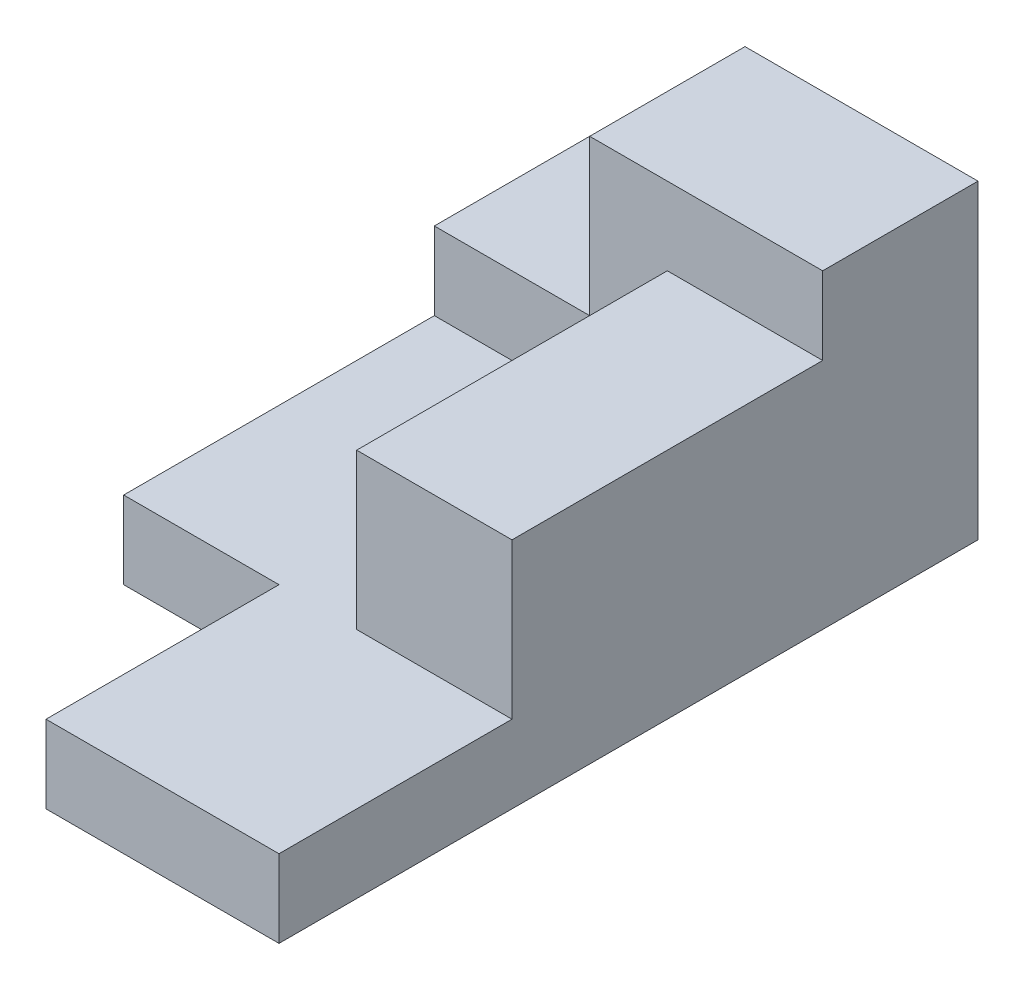
ISO-10303-21;
HEADER;
FILE_DESCRIPTION(('STEP AP214'),'2;1');
FILE_NAME('part.step','',(''),(''),'','','');
FILE_SCHEMA(('AUTOMOTIVE_DESIGN { 1 0 10303 214 1 1 1 1 }'));
ENDSEC;
DATA;
#1=APPLICATION_CONTEXT('core data for automotive mechanical design processes');
#2=APPLICATION_PROTOCOL_DEFINITION('international standard','automotive_design',2000,#1);
#3=PRODUCT_CONTEXT('',#1,'mechanical');
#4=PRODUCT('Part','Part','',(#3));
#5=PRODUCT_RELATED_PRODUCT_CATEGORY('part','',(#4));
#6=PRODUCT_DEFINITION_FORMATION('','',#4);
#7=PRODUCT_DEFINITION_CONTEXT('part definition',#1,'design');
#8=PRODUCT_DEFINITION('design','',#6,#7);
#9=PRODUCT_DEFINITION_SHAPE('','',#8);
#10=(LENGTH_UNIT() NAMED_UNIT(*) SI_UNIT(.MILLI.,.METRE.));
#11=(NAMED_UNIT(*) PLANE_ANGLE_UNIT() SI_UNIT($,.RADIAN.));
#12=(NAMED_UNIT(*) SI_UNIT($,.STERADIAN.) SOLID_ANGLE_UNIT());
#13=UNCERTAINTY_MEASURE_WITH_UNIT(LENGTH_MEASURE(1.E-05),#10,'distance_accuracy_value','');
#14=(GEOMETRIC_REPRESENTATION_CONTEXT(3) GLOBAL_UNCERTAINTY_ASSIGNED_CONTEXT((#13)) GLOBAL_UNIT_ASSIGNED_CONTEXT((#10,
#11,#12)) REPRESENTATION_CONTEXT('',''));
#15=CARTESIAN_POINT('',(0.,0.,0.));
#16=DIRECTION('',(0.,0.,1.));
#17=DIRECTION('',(1.,0.,0.));
#18=AXIS2_PLACEMENT_3D('',#15,#16,#17);
#19=CARTESIAN_POINT('',(0.,10.,0.));
#20=DIRECTION('',(0.,1.,0.));
#21=DIRECTION('',(0.,0.,1.));
#22=AXIS2_PLACEMENT_3D('',#19,#20,#21);
#23=PLANE('',#22);
#24=DIRECTION('',(1.,0.,0.));
#25=VECTOR('',#24,1.);
#26=CARTESIAN_POINT('',(19.7674418604651,10.,36.1627906976744));
#27=LINE('',#26,#25);
#28=CARTESIAN_POINT('',(-0.232558139534853,10.,36.1627906976744));
#29=VERTEX_POINT('',#28);
#30=CARTESIAN_POINT('',(19.7674418604652,10.,36.1627906976744));
#31=VERTEX_POINT('',#30);
#32=EDGE_CURVE('E55',#29,#31,#27,.T.);
#33=ORIENTED_EDGE('',*,*,#32,.F.);
#34=DIRECTION('',(0.,0.,1.));
#35=VECTOR('',#34,1.);
#36=CARTESIAN_POINT('',(-0.232558139534858,10.,-3.83720930232558));
#37=LINE('',#36,#35);
#38=CARTESIAN_POINT('',(-0.232558139534857,10.,-3.83720930232558));
#39=VERTEX_POINT('',#38);
#40=EDGE_CURVE('E166',#39,#29,#37,.T.);
#41=ORIENTED_EDGE('',*,*,#40,.F.);
#42=DIRECTION('',(1.,0.,0.));
#43=VECTOR('',#42,1.);
#44=CARTESIAN_POINT('',(-30.2325581395349,10.,-3.83720930232558));
#45=LINE('',#44,#43);
#46=CARTESIAN_POINT('',(-30.2325581395349,10.,-3.83720930232559));
#47=VERTEX_POINT('',#46);
#48=EDGE_CURVE('E139',#47,#39,#45,.T.);
#49=ORIENTED_EDGE('',*,*,#48,.F.);
#50=DIRECTION('',(0.,0.,1.));
#51=VECTOR('',#50,1.);
#52=CARTESIAN_POINT('',(-30.2325581395349,10.,-23.8372093023256));
#53=LINE('',#52,#51);
#54=CARTESIAN_POINT('',(-30.2325581395349,10.,36.1627906976744));
#55=VERTEX_POINT('',#54);
#56=EDGE_CURVE('E247',#47,#55,#53,.T.);
#57=ORIENTED_EDGE('',*,*,#56,.T.);
#58=DIRECTION('',(-1.,0.,0.));
#59=VECTOR('',#58,1.);
#60=CARTESIAN_POINT('',(0.,10.,36.1627906976744));
#61=LINE('',#60,#59);
#62=CARTESIAN_POINT('',(-10.2325581395349,10.,36.1627906976744));
#63=VERTEX_POINT('',#62);
#64=EDGE_CURVE('E242',#63,#55,#61,.T.);
#65=ORIENTED_EDGE('',*,*,#64,.F.);
#66=DIRECTION('',(0.,0.,-1.));
#67=VECTOR('',#66,1.);
#68=CARTESIAN_POINT('',(-10.2325581395349,10.,0.));
#69=LINE('',#68,#67);
#70=CARTESIAN_POINT('',(-10.2325581395349,10.,66.1627906976744));
#71=VERTEX_POINT('',#70);
#72=EDGE_CURVE('E233',#71,#63,#69,.T.);
#73=ORIENTED_EDGE('',*,*,#72,.F.);
#74=DIRECTION('',(1.,0.,0.));
#75=VECTOR('',#74,1.);
#76=CARTESIAN_POINT('',(-30.2325581395348,10.,66.1627906976744));
#77=LINE('',#76,#75);
#78=CARTESIAN_POINT('',(19.7674418604652,10.,66.1627906976744));
#79=VERTEX_POINT('',#78);
#80=EDGE_CURVE('E250',#71,#79,#77,.T.);
#81=ORIENTED_EDGE('',*,*,#80,.T.);
#82=DIRECTION('',(0.,0.,-1.));
#83=VECTOR('',#82,1.);
#84=CARTESIAN_POINT('',(19.7674418604651,10.,-23.8372093023256));
#85=LINE('',#84,#83);
#86=EDGE_CURVE('E60',#79,#31,#85,.T.);
#87=ORIENTED_EDGE('',*,*,#86,.T.);
#88=EDGE_LOOP('',(#33,#41,#49,#57,#65,#73,#81,#87));
#89=FACE_BOUND('',#88,.T.);
#90=ADVANCED_FACE('F39',(#89),#23,.T.);
#91=CARTESIAN_POINT('',(-30.2325581395349,20.,-3.83720930232558));
#92=DIRECTION('',(0.,0.,-1.));
#93=DIRECTION('',(-1.,0.,0.));
#94=AXIS2_PLACEMENT_3D('',#91,#92,#93);
#95=PLANE('',#94);
#96=DIRECTION('',(0.,-1.,0.));
#97=VECTOR('',#96,1.);
#98=CARTESIAN_POINT('',(-0.232558139534858,30.,-3.83720930232558));
#99=LINE('',#98,#97);
#100=CARTESIAN_POINT('',(-0.232558139534858,30.,-3.83720930232558));
#101=VERTEX_POINT('',#100);
#102=EDGE_CURVE('E133',#101,#39,#99,.T.);
#103=ORIENTED_EDGE('',*,*,#102,.F.);
#104=DIRECTION('',(-1.,0.,0.));
#105=VECTOR('',#104,1.);
#106=CARTESIAN_POINT('',(19.7674418604651,30.,-3.83720930232558));
#107=LINE('',#106,#105);
#108=CARTESIAN_POINT('',(19.7674418604651,30.,-3.83720930232558));
#109=VERTEX_POINT('',#108);
#110=EDGE_CURVE('E136',#109,#101,#107,.T.);
#111=ORIENTED_EDGE('',*,*,#110,.F.);
#112=DIRECTION('',(0.,-1.,0.));
#113=VECTOR('',#112,1.);
#114=CARTESIAN_POINT('',(19.7674418604651,20.,-3.83720930232558));
#115=LINE('',#114,#113);
#116=CARTESIAN_POINT('',(19.7674418604651,40.,-3.83720930232558));
#117=VERTEX_POINT('',#116);
#118=EDGE_CURVE('E212',#117,#109,#115,.T.);
#119=ORIENTED_EDGE('',*,*,#118,.F.);
#120=DIRECTION('',(1.,0.,0.));
#121=VECTOR('',#120,1.);
#122=CARTESIAN_POINT('',(-10.2325581395349,40.,-3.83720930232558));
#123=LINE('',#122,#121);
#124=CARTESIAN_POINT('',(-10.2325581395349,40.,-3.83720930232558));
#125=VERTEX_POINT('',#124);
#126=EDGE_CURVE('E180',#125,#117,#123,.T.);
#127=ORIENTED_EDGE('',*,*,#126,.F.);
#128=DIRECTION('',(0.,-1.,0.));
#129=VECTOR('',#128,1.);
#130=CARTESIAN_POINT('',(-10.2325581395349,40.,-3.83720930232558));
#131=LINE('',#130,#129);
#132=CARTESIAN_POINT('',(-10.2325581395349,20.,-3.83720930232558));
#133=VERTEX_POINT('',#132);
#134=EDGE_CURVE('E198',#125,#133,#131,.T.);
#135=ORIENTED_EDGE('',*,*,#134,.T.);
#136=DIRECTION('',(1.,0.,0.));
#137=VECTOR('',#136,1.);
#138=CARTESIAN_POINT('',(-30.2325581395349,20.,-3.83720930232558));
#139=LINE('',#138,#137);
#140=CARTESIAN_POINT('',(-30.2325581395349,20.,-3.83720930232558));
#141=VERTEX_POINT('',#140);
#142=EDGE_CURVE('E206',#141,#133,#139,.T.);
#143=ORIENTED_EDGE('',*,*,#142,.F.);
#144=DIRECTION('',(0.,-1.,0.));
#145=VECTOR('',#144,1.);
#146=CARTESIAN_POINT('',(-30.2325581395349,20.,-3.83720930232558));
#147=LINE('',#146,#145);
#148=EDGE_CURVE('E217',#141,#47,#147,.T.);
#149=ORIENTED_EDGE('',*,*,#148,.T.);
#150=ORIENTED_EDGE('',*,*,#48,.T.);
#151=EDGE_LOOP('',(#103,#111,#119,#127,#135,#143,#149,#150));
#152=FACE_BOUND('',#151,.T.);
#153=ADVANCED_FACE('F135',(#152),#95,.F.);
#154=CARTESIAN_POINT('',(-30.2325581395349,10.,-23.8372093023256));
#155=DIRECTION('',(1.,0.,0.));
#156=DIRECTION('',(0.,0.,-1.));
#157=AXIS2_PLACEMENT_3D('',#154,#155,#156);
#158=PLANE('',#157);
#159=DIRECTION('',(0.,0.,1.));
#160=VECTOR('',#159,1.);
#161=CARTESIAN_POINT('',(-30.2325581395349,0.,-23.8372093023256));
#162=LINE('',#161,#160);
#163=CARTESIAN_POINT('',(-30.2325581395349,0.,-23.8372093023256));
#164=VERTEX_POINT('',#163);
#165=CARTESIAN_POINT('',(-30.2325581395349,0.,36.1627906976744));
#166=VERTEX_POINT('',#165);
#167=EDGE_CURVE('E246',#164,#166,#162,.T.);
#168=ORIENTED_EDGE('',*,*,#167,.T.);
#169=DIRECTION('',(0.,1.,0.));
#170=VECTOR('',#169,1.);
#171=CARTESIAN_POINT('',(-30.2325581395349,0.,36.1627906976744));
#172=LINE('',#171,#170);
#173=EDGE_CURVE('E229',#166,#55,#172,.T.);
#174=ORIENTED_EDGE('',*,*,#173,.T.);
#175=ORIENTED_EDGE('',*,*,#56,.F.);
#176=ORIENTED_EDGE('',*,*,#148,.F.);
#177=DIRECTION('',(0.,0.,1.));
#178=VECTOR('',#177,1.);
#179=CARTESIAN_POINT('',(-30.2325581395349,20.,-23.8372093023256));
#180=LINE('',#179,#178);
#181=CARTESIAN_POINT('',(-30.2325581395349,20.,-23.8372093023256));
#182=VERTEX_POINT('',#181);
#183=EDGE_CURVE('E202',#182,#141,#180,.T.);
#184=ORIENTED_EDGE('',*,*,#183,.F.);
#185=DIRECTION('',(0.,-1.,0.));
#186=VECTOR('',#185,1.);
#187=CARTESIAN_POINT('',(-30.2325581395349,10.,-23.8372093023256));
#188=LINE('',#187,#186);
#189=EDGE_CURVE('E256',#182,#164,#188,.T.);
#190=ORIENTED_EDGE('',*,*,#189,.T.);
#191=EDGE_LOOP('',(#168,#174,#175,#176,#184,#190));
#192=FACE_BOUND('',#191,.T.);
#193=ADVANCED_FACE('F41',(#192),#158,.F.);
#194=CARTESIAN_POINT('',(-30.2325581395348,10.,66.1627906976744));
#195=DIRECTION('',(0.,0.,-1.));
#196=DIRECTION('',(-1.,0.,0.));
#197=AXIS2_PLACEMENT_3D('',#194,#195,#196);
#198=PLANE('',#197);
#199=ORIENTED_EDGE('',*,*,#80,.F.);
#200=DIRECTION('',(0.,1.,0.));
#201=VECTOR('',#200,1.);
#202=CARTESIAN_POINT('',(-10.2325581395349,0.,66.1627906976744));
#203=LINE('',#202,#201);
#204=CARTESIAN_POINT('',(-10.2325581395349,0.,66.1627906976744));
#205=VERTEX_POINT('',#204);
#206=EDGE_CURVE('E228',#205,#71,#203,.T.);
#207=ORIENTED_EDGE('',*,*,#206,.F.);
#208=DIRECTION('',(1.,0.,0.));
#209=VECTOR('',#208,1.);
#210=CARTESIAN_POINT('',(-30.2325581395348,0.,66.1627906976744));
#211=LINE('',#210,#209);
#212=CARTESIAN_POINT('',(19.7674418604652,0.,66.1627906976744));
#213=VERTEX_POINT('',#212);
#214=EDGE_CURVE('E260',#205,#213,#211,.T.);
#215=ORIENTED_EDGE('',*,*,#214,.T.);
#216=DIRECTION('',(0.,-1.,0.));
#217=VECTOR('',#216,1.);
#218=CARTESIAN_POINT('',(19.7674418604652,10.,66.1627906976744));
#219=LINE('',#218,#217);
#220=EDGE_CURVE('E11',#79,#213,#219,.T.);
#221=ORIENTED_EDGE('',*,*,#220,.F.);
#222=EDGE_LOOP('',(#199,#207,#215,#221));
#223=FACE_BOUND('',#222,.T.);
#224=ADVANCED_FACE('F310',(#223),#198,.F.);
#225=CARTESIAN_POINT('',(19.7674418604651,10.,-23.8372093023256));
#226=DIRECTION('',(-1.,0.,0.));
#227=DIRECTION('',(0.,0.,1.));
#228=AXIS2_PLACEMENT_3D('',#225,#226,#227);
#229=PLANE('',#228);
#230=DIRECTION('',(0.,0.,-1.));
#231=VECTOR('',#230,1.);
#232=CARTESIAN_POINT('',(19.7674418604651,0.,-23.8372093023256));
#233=LINE('',#232,#231);
#234=CARTESIAN_POINT('',(19.7674418604651,0.,-23.8372093023256));
#235=VERTEX_POINT('',#234);
#236=EDGE_CURVE('E263',#213,#235,#233,.T.);
#237=ORIENTED_EDGE('',*,*,#236,.T.);
#238=DIRECTION('',(0.,-1.,0.));
#239=VECTOR('',#238,1.);
#240=CARTESIAN_POINT('',(19.7674418604651,10.,-23.8372093023256));
#241=LINE('',#240,#239);
#242=CARTESIAN_POINT('',(19.7674418604651,40.,-23.8372093023256));
#243=VERTEX_POINT('',#242);
#244=EDGE_CURVE('E48',#243,#235,#241,.T.);
#245=ORIENTED_EDGE('',*,*,#244,.F.);
#246=DIRECTION('',(0.,0.,-1.));
#247=VECTOR('',#246,1.);
#248=CARTESIAN_POINT('',(19.7674418604651,40.,-3.83720930232558));
#249=LINE('',#248,#247);
#250=EDGE_CURVE('E184',#117,#243,#249,.T.);
#251=ORIENTED_EDGE('',*,*,#250,.F.);
#252=ORIENTED_EDGE('',*,*,#118,.T.);
#253=DIRECTION('',(0.,0.,-1.));
#254=VECTOR('',#253,1.);
#255=CARTESIAN_POINT('',(19.7674418604651,30.,-3.83720930232558));
#256=LINE('',#255,#254);
#257=CARTESIAN_POINT('',(19.7674418604651,30.,36.1627906976744));
#258=VERTEX_POINT('',#257);
#259=EDGE_CURVE('E152',#258,#109,#256,.T.);
#260=ORIENTED_EDGE('',*,*,#259,.F.);
#261=DIRECTION('',(0.,-1.,0.));
#262=VECTOR('',#261,1.);
#263=CARTESIAN_POINT('',(19.7674418604651,30.,36.1627906976744));
#264=LINE('',#263,#262);
#265=EDGE_CURVE('E162',#258,#31,#264,.T.);
#266=ORIENTED_EDGE('',*,*,#265,.T.);
#267=ORIENTED_EDGE('',*,*,#86,.F.);
#268=ORIENTED_EDGE('',*,*,#220,.T.);
#269=EDGE_LOOP('',(#237,#245,#251,#252,#260,#266,#267,#268));
#270=FACE_BOUND('',#269,.T.);
#271=ADVANCED_FACE('F297',(#270),#229,.F.);
#272=CARTESIAN_POINT('',(-30.2325581395349,10.,-23.8372093023256));
#273=DIRECTION('',(0.,0.,1.));
#274=DIRECTION('',(1.,0.,0.));
#275=AXIS2_PLACEMENT_3D('',#272,#273,#274);
#276=PLANE('',#275);
#277=DIRECTION('',(-1.,0.,0.));
#278=VECTOR('',#277,1.);
#279=CARTESIAN_POINT('',(-30.2325581395349,0.,-23.8372093023256));
#280=LINE('',#279,#278);
#281=EDGE_CURVE('E251',#235,#164,#280,.T.);
#282=ORIENTED_EDGE('',*,*,#281,.T.);
#283=ORIENTED_EDGE('',*,*,#189,.F.);
#284=DIRECTION('',(-1.,0.,0.));
#285=VECTOR('',#284,1.);
#286=CARTESIAN_POINT('',(-30.2325581395349,20.,-23.8372093023256));
#287=LINE('',#286,#285);
#288=CARTESIAN_POINT('',(-10.2325581395349,20.,-23.8372093023256));
#289=VERTEX_POINT('',#288);
#290=EDGE_CURVE('E209',#289,#182,#287,.T.);
#291=ORIENTED_EDGE('',*,*,#290,.F.);
#292=DIRECTION('',(0.,-1.,0.));
#293=VECTOR('',#292,1.);
#294=CARTESIAN_POINT('',(-10.2325581395349,40.,-23.8372093023256));
#295=LINE('',#294,#293);
#296=CARTESIAN_POINT('',(-10.2325581395349,40.,-23.8372093023256));
#297=VERTEX_POINT('',#296);
#298=EDGE_CURVE('E191',#297,#289,#295,.T.);
#299=ORIENTED_EDGE('',*,*,#298,.F.);
#300=DIRECTION('',(-1.,0.,0.));
#301=VECTOR('',#300,1.);
#302=CARTESIAN_POINT('',(-10.2325581395349,40.,-23.8372093023256));
#303=LINE('',#302,#301);
#304=EDGE_CURVE('E188',#243,#297,#303,.T.);
#305=ORIENTED_EDGE('',*,*,#304,.F.);
#306=ORIENTED_EDGE('',*,*,#244,.T.);
#307=EDGE_LOOP('',(#282,#283,#291,#299,#305,#306));
#308=FACE_BOUND('',#307,.T.);
#309=ADVANCED_FACE('F275',(#308),#276,.F.);
#310=CARTESIAN_POINT('',(0.,0.,0.));
#311=DIRECTION('',(0.,1.,0.));
#312=DIRECTION('',(0.,0.,1.));
#313=AXIS2_PLACEMENT_3D('',#310,#311,#312);
#314=PLANE('',#313);
#315=DIRECTION('',(0.,0.,-1.));
#316=VECTOR('',#315,1.);
#317=CARTESIAN_POINT('',(-10.2325581395349,0.,36.1627906976744));
#318=LINE('',#317,#316);
#319=CARTESIAN_POINT('',(-10.2325581395349,0.,36.1627906976744));
#320=VERTEX_POINT('',#319);
#321=EDGE_CURVE('E220',#205,#320,#318,.T.);
#322=ORIENTED_EDGE('',*,*,#321,.T.);
#323=DIRECTION('',(-1.,0.,0.));
#324=VECTOR('',#323,1.);
#325=CARTESIAN_POINT('',(-30.2325581395349,0.,36.1627906976744));
#326=LINE('',#325,#324);
#327=EDGE_CURVE('E224',#320,#166,#326,.T.);
#328=ORIENTED_EDGE('',*,*,#327,.T.);
#329=ORIENTED_EDGE('',*,*,#167,.F.);
#330=ORIENTED_EDGE('',*,*,#281,.F.);
#331=ORIENTED_EDGE('',*,*,#236,.F.);
#332=ORIENTED_EDGE('',*,*,#214,.F.);
#333=EDGE_LOOP('',(#322,#328,#329,#330,#331,#332));
#334=FACE_BOUND('',#333,.T.);
#335=ADVANCED_FACE('F283',(#334),#314,.F.);
#336=CARTESIAN_POINT('',(-30.2325581395349,0.,36.1627906976744));
#337=DIRECTION('',(0.,0.,-1.));
#338=DIRECTION('',(-1.,0.,0.));
#339=AXIS2_PLACEMENT_3D('',#336,#337,#338);
#340=PLANE('',#339);
#341=ORIENTED_EDGE('',*,*,#64,.T.);
#342=ORIENTED_EDGE('',*,*,#173,.F.);
#343=ORIENTED_EDGE('',*,*,#327,.F.);
#344=DIRECTION('',(0.,1.,0.));
#345=VECTOR('',#344,1.);
#346=CARTESIAN_POINT('',(-10.2325581395349,0.,36.1627906976744));
#347=LINE('',#346,#345);
#348=EDGE_CURVE('E234',#320,#63,#347,.T.);
#349=ORIENTED_EDGE('',*,*,#348,.T.);
#350=EDGE_LOOP('',(#341,#342,#343,#349));
#351=FACE_BOUND('',#350,.T.);
#352=ADVANCED_FACE('F302',(#351),#340,.F.);
#353=CARTESIAN_POINT('',(-10.2325581395349,0.,36.1627906976744));
#354=DIRECTION('',(1.,0.,0.));
#355=DIRECTION('',(0.,0.,-1.));
#356=AXIS2_PLACEMENT_3D('',#353,#354,#355);
#357=PLANE('',#356);
#358=ORIENTED_EDGE('',*,*,#72,.T.);
#359=ORIENTED_EDGE('',*,*,#348,.F.);
#360=ORIENTED_EDGE('',*,*,#321,.F.);
#361=ORIENTED_EDGE('',*,*,#206,.T.);
#362=EDGE_LOOP('',(#358,#359,#360,#361));
#363=FACE_BOUND('',#362,.T.);
#364=ADVANCED_FACE('F305',(#363),#357,.F.);
#365=CARTESIAN_POINT('',(0.,20.,0.));
#366=DIRECTION('',(0.,1.,0.));
#367=DIRECTION('',(0.,0.,1.));
#368=AXIS2_PLACEMENT_3D('',#365,#366,#367);
#369=PLANE('',#368);
#370=DIRECTION('',(0.,0.,1.));
#371=VECTOR('',#370,1.);
#372=CARTESIAN_POINT('',(-10.2325581395349,20.,-3.83720930232558));
#373=LINE('',#372,#371);
#374=EDGE_CURVE('E143',#289,#133,#373,.T.);
#375=ORIENTED_EDGE('',*,*,#374,.F.);
#376=ORIENTED_EDGE('',*,*,#290,.T.);
#377=ORIENTED_EDGE('',*,*,#183,.T.);
#378=ORIENTED_EDGE('',*,*,#142,.T.);
#379=EDGE_LOOP('',(#375,#376,#377,#378));
#380=FACE_BOUND('',#379,.T.);
#381=ADVANCED_FACE('F298',(#380),#369,.T.);
#382=CARTESIAN_POINT('',(-10.2325581395349,40.,-3.83720930232558));
#383=DIRECTION('',(1.,0.,0.));
#384=DIRECTION('',(0.,0.,-1.));
#385=AXIS2_PLACEMENT_3D('',#382,#383,#384);
#386=PLANE('',#385);
#387=ORIENTED_EDGE('',*,*,#374,.T.);
#388=ORIENTED_EDGE('',*,*,#134,.F.);
#389=DIRECTION('',(0.,0.,1.));
#390=VECTOR('',#389,1.);
#391=CARTESIAN_POINT('',(-10.2325581395349,40.,-3.83720930232558));
#392=LINE('',#391,#390);
#393=EDGE_CURVE('E176',#297,#125,#392,.T.);
#394=ORIENTED_EDGE('',*,*,#393,.F.);
#395=ORIENTED_EDGE('',*,*,#298,.T.);
#396=EDGE_LOOP('',(#387,#388,#394,#395));
#397=FACE_BOUND('',#396,.T.);
#398=ADVANCED_FACE('F293',(#397),#386,.F.);
#399=CARTESIAN_POINT('',(0.,40.,0.));
#400=DIRECTION('',(0.,-1.,0.));
#401=DIRECTION('',(0.,0.,-1.));
#402=AXIS2_PLACEMENT_3D('',#399,#400,#401);
#403=PLANE('',#402);
#404=ORIENTED_EDGE('',*,*,#393,.T.);
#405=ORIENTED_EDGE('',*,*,#126,.T.);
#406=ORIENTED_EDGE('',*,*,#250,.T.);
#407=ORIENTED_EDGE('',*,*,#304,.T.);
#408=EDGE_LOOP('',(#404,#405,#406,#407));
#409=FACE_BOUND('',#408,.T.);
#410=ADVANCED_FACE('F296',(#409),#403,.F.);
#411=CARTESIAN_POINT('',(-0.232558139534858,30.,-3.83720930232558));
#412=DIRECTION('',(1.,0.,0.));
#413=DIRECTION('',(0.,0.,-1.));
#414=AXIS2_PLACEMENT_3D('',#411,#412,#413);
#415=PLANE('',#414);
#416=ORIENTED_EDGE('',*,*,#40,.T.);
#417=DIRECTION('',(0.,-1.,0.));
#418=VECTOR('',#417,1.);
#419=CARTESIAN_POINT('',(-0.232558139534853,30.,36.1627906976744));
#420=LINE('',#419,#418);
#421=CARTESIAN_POINT('',(-0.232558139534853,30.,36.1627906976744));
#422=VERTEX_POINT('',#421);
#423=EDGE_CURVE('E144',#422,#29,#420,.T.);
#424=ORIENTED_EDGE('',*,*,#423,.F.);
#425=DIRECTION('',(0.,0.,1.));
#426=VECTOR('',#425,1.);
#427=CARTESIAN_POINT('',(-0.232558139534858,30.,-3.83720930232558));
#428=LINE('',#427,#426);
#429=EDGE_CURVE('E149',#101,#422,#428,.T.);
#430=ORIENTED_EDGE('',*,*,#429,.F.);
#431=ORIENTED_EDGE('',*,*,#102,.T.);
#432=EDGE_LOOP('',(#416,#424,#430,#431));
#433=FACE_BOUND('',#432,.T.);
#434=ADVANCED_FACE('F155',(#433),#415,.F.);
#435=CARTESIAN_POINT('',(19.7674418604651,30.,36.1627906976744));
#436=DIRECTION('',(0.,0.,-1.));
#437=DIRECTION('',(-1.,0.,0.));
#438=AXIS2_PLACEMENT_3D('',#435,#436,#437);
#439=PLANE('',#438);
#440=ORIENTED_EDGE('',*,*,#32,.T.);
#441=ORIENTED_EDGE('',*,*,#265,.F.);
#442=DIRECTION('',(1.,0.,0.));
#443=VECTOR('',#442,1.);
#444=CARTESIAN_POINT('',(19.7674418604651,30.,36.1627906976744));
#445=LINE('',#444,#443);
#446=EDGE_CURVE('E159',#422,#258,#445,.T.);
#447=ORIENTED_EDGE('',*,*,#446,.F.);
#448=ORIENTED_EDGE('',*,*,#423,.T.);
#449=EDGE_LOOP('',(#440,#441,#447,#448));
#450=FACE_BOUND('',#449,.T.);
#451=ADVANCED_FACE('F313',(#450),#439,.F.);
#452=CARTESIAN_POINT('',(0.,30.,0.));
#453=DIRECTION('',(0.,-1.,0.));
#454=DIRECTION('',(0.,0.,-1.));
#455=AXIS2_PLACEMENT_3D('',#452,#453,#454);
#456=PLANE('',#455);
#457=ORIENTED_EDGE('',*,*,#259,.T.);
#458=ORIENTED_EDGE('',*,*,#110,.T.);
#459=ORIENTED_EDGE('',*,*,#429,.T.);
#460=ORIENTED_EDGE('',*,*,#446,.T.);
#461=EDGE_LOOP('',(#457,#458,#459,#460));
#462=FACE_BOUND('',#461,.T.);
#463=ADVANCED_FACE('F148',(#462),#456,.F.);
#464=CLOSED_SHELL('',(#90,#153,#193,#224,#271,#309,#335,#352,#364,#381,#398,#410,#434,#451,#463));
#465=MANIFOLD_SOLID_BREP('B2',#464);
#466=ADVANCED_BREP_SHAPE_REPRESENTATION('',(#18,#465),#14);
#467=SHAPE_DEFINITION_REPRESENTATION(#9,#466);
ENDSEC;
END-ISO-10303-21;
